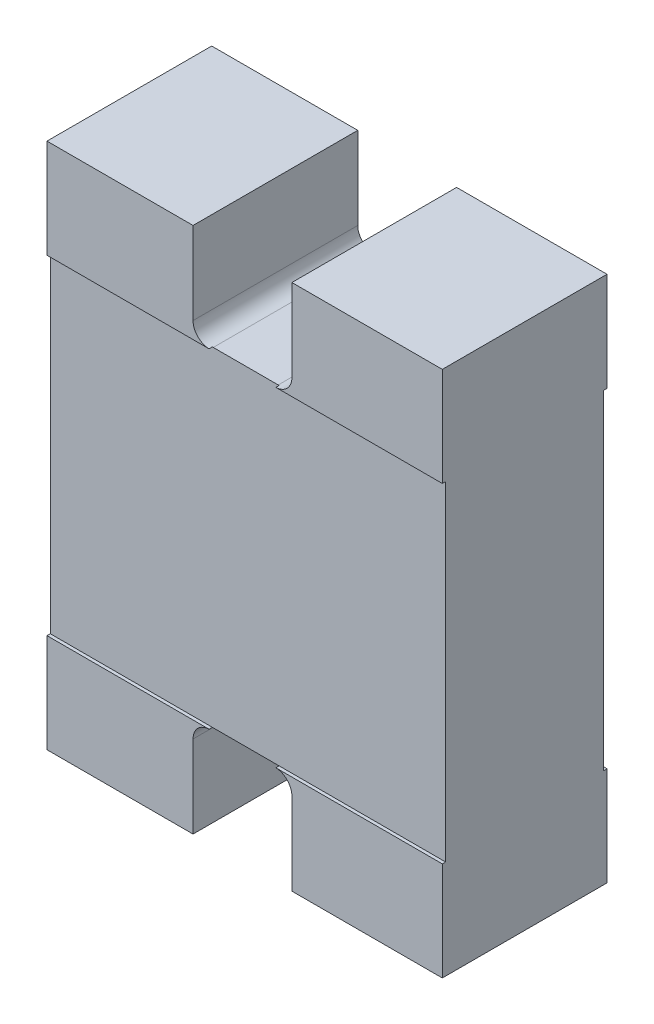
ISO-10303-21;
HEADER;
FILE_DESCRIPTION(('STEP AP214'),'2;1');
FILE_NAME('part.step','',(''),(''),'','','');
FILE_SCHEMA(('AUTOMOTIVE_DESIGN { 1 0 10303 214 1 1 1 1 }'));
ENDSEC;
DATA;
#1=APPLICATION_CONTEXT('core data for automotive mechanical design processes');
#2=APPLICATION_PROTOCOL_DEFINITION('international standard','automotive_design',2000,#1);
#3=PRODUCT_CONTEXT('',#1,'mechanical');
#4=PRODUCT('Part','Part','',(#3));
#5=PRODUCT_RELATED_PRODUCT_CATEGORY('part','',(#4));
#6=PRODUCT_DEFINITION_FORMATION('','',#4);
#7=PRODUCT_DEFINITION_CONTEXT('part definition',#1,'design');
#8=PRODUCT_DEFINITION('design','',#6,#7);
#9=PRODUCT_DEFINITION_SHAPE('','',#8);
#10=(LENGTH_UNIT() NAMED_UNIT(*) SI_UNIT(.MILLI.,.METRE.));
#11=(NAMED_UNIT(*) PLANE_ANGLE_UNIT() SI_UNIT($,.RADIAN.));
#12=(NAMED_UNIT(*) SI_UNIT($,.STERADIAN.) SOLID_ANGLE_UNIT());
#13=UNCERTAINTY_MEASURE_WITH_UNIT(LENGTH_MEASURE(1.E-05),#10,'distance_accuracy_value','');
#14=(GEOMETRIC_REPRESENTATION_CONTEXT(3) GLOBAL_UNCERTAINTY_ASSIGNED_CONTEXT((#13)) GLOBAL_UNIT_ASSIGNED_CONTEXT((#10,
#11,#12)) REPRESENTATION_CONTEXT('',''));
#15=CARTESIAN_POINT('',(0.,0.,0.));
#16=DIRECTION('',(0.,0.,1.));
#17=DIRECTION('',(1.,0.,0.));
#18=AXIS2_PLACEMENT_3D('',#15,#16,#17);
#19=CARTESIAN_POINT('',(0.,0.,0.5));
#20=DIRECTION('',(0.,0.,1.));
#21=DIRECTION('',(1.,0.,0.));
#22=AXIS2_PLACEMENT_3D('',#19,#20,#21);
#23=PLANE('',#22);
#24=DIRECTION('',(0.,1.,0.));
#25=VECTOR('',#24,1.);
#26=CARTESIAN_POINT('',(0.6,0.8,0.5));
#27=LINE('',#26,#25);
#28=CARTESIAN_POINT('',(0.6,-0.8,0.5));
#29=VERTEX_POINT('',#28);
#30=CARTESIAN_POINT('',(0.6,-0.500000000000838,0.5));
#31=VERTEX_POINT('',#30);
#32=EDGE_CURVE('E398',#29,#31,#27,.T.);
#33=ORIENTED_EDGE('',*,*,#32,.T.);
#34=DIRECTION('',(-1.,0.,0.));
#35=VECTOR('',#34,1.);
#36=CARTESIAN_POINT('',(0.6,-0.500000000000838,0.5));
#37=LINE('',#36,#35);
#38=CARTESIAN_POINT('',(0.0947676380211681,-0.500000000000838,0.5));
#39=VERTEX_POINT('',#38);
#40=EDGE_CURVE('E535',#31,#39,#37,.T.);
#41=ORIENTED_EDGE('',*,*,#40,.T.);
#42=CARTESIAN_POINT('',(0.0933814284328622,-0.549979938272866,0.5));
#43=DIRECTION('',(0.,0.,1.));
#44=DIRECTION('',(-1.,0.,0.));
#45=AXIS2_PLACEMENT_3D('',#42,#43,#44);
#46=CIRCLE('',#45,0.0499991580598961);
#47=CARTESIAN_POINT('',(0.143380586492758,-0.549979938272866,0.5));
#48=VERTEX_POINT('',#47);
#49=EDGE_CURVE('E526',#48,#39,#46,.T.);
#50=ORIENTED_EDGE('',*,*,#49,.F.);
#51=DIRECTION('',(-1.05897102086358E-06,0.999999999999439,0.));
#52=VECTOR('',#51,1.);
#53=CARTESIAN_POINT('',(0.143380851256758,-0.8,0.5));
#54=LINE('',#53,#52);
#55=CARTESIAN_POINT('',(0.143380851256758,-0.8,0.5));
#56=VERTEX_POINT('',#55);
#57=EDGE_CURVE('E120',#56,#48,#54,.T.);
#58=ORIENTED_EDGE('',*,*,#57,.F.);
#59=DIRECTION('',(1.,0.,0.));
#60=VECTOR('',#59,1.);
#61=CARTESIAN_POINT('',(-0.6,-0.8,0.5));
#62=LINE('',#61,#60);
#63=EDGE_CURVE('E407',#56,#29,#62,.T.);
#64=ORIENTED_EDGE('',*,*,#63,.T.);
#65=EDGE_LOOP('',(#33,#41,#50,#58,#64));
#66=FACE_BOUND('',#65,.T.);
#67=ADVANCED_FACE('F35',(#66),#23,.T.);
#68=CARTESIAN_POINT('',(-0.106619990683346,-0.549979938272866,0.5));
#69=DIRECTION('',(0.,0.,1.));
#70=DIRECTION('',(1.,0.,0.));
#71=AXIS2_PLACEMENT_3D('',#68,#69,#70);
#72=CIRCLE('',#71,0.0499991580598962);
#73=CARTESIAN_POINT('',(-0.108006200271658,-0.500000000000838,0.5));
#74=VERTEX_POINT('',#73);
#75=CARTESIAN_POINT('',(-0.156619148743242,-0.549979938272866,0.5));
#76=VERTEX_POINT('',#75);
#77=EDGE_CURVE('E524',#74,#76,#72,.T.);
#78=ORIENTED_EDGE('',*,*,#77,.F.);
#79=CARTESIAN_POINT('',(-0.6,-0.500000000000838,0.5));
#80=VERTEX_POINT('',#79);
#81=EDGE_CURVE('E421',#74,#80,#37,.T.);
#82=ORIENTED_EDGE('',*,*,#81,.T.);
#83=DIRECTION('',(0.,-1.,0.));
#84=VECTOR('',#83,1.);
#85=CARTESIAN_POINT('',(-0.6,0.8,0.5));
#86=LINE('',#85,#84);
#87=CARTESIAN_POINT('',(-0.6,-0.8,0.5));
#88=VERTEX_POINT('',#87);
#89=EDGE_CURVE('E404',#80,#88,#86,.T.);
#90=ORIENTED_EDGE('',*,*,#89,.T.);
#91=CARTESIAN_POINT('',(-0.156619148743242,-0.8,0.5));
#92=VERTEX_POINT('',#91);
#93=EDGE_CURVE('E192',#88,#92,#62,.T.);
#94=ORIENTED_EDGE('',*,*,#93,.T.);
#95=DIRECTION('',(0.,-1.,0.));
#96=VECTOR('',#95,1.);
#97=CARTESIAN_POINT('',(-0.156619148743242,-0.8,0.5));
#98=LINE('',#97,#96);
#99=EDGE_CURVE('E137',#76,#92,#98,.T.);
#100=ORIENTED_EDGE('',*,*,#99,.F.);
#101=EDGE_LOOP('',(#78,#82,#90,#94,#100));
#102=FACE_BOUND('',#101,.T.);
#103=ADVANCED_FACE('F417',(#102),#23,.T.);
#104=CARTESIAN_POINT('',(-0.6,0.8,0.5));
#105=VERTEX_POINT('',#104);
#106=CARTESIAN_POINT('',(-0.6,0.500000000000838,0.5));
#107=VERTEX_POINT('',#106);
#108=EDGE_CURVE('E405',#105,#107,#86,.T.);
#109=ORIENTED_EDGE('',*,*,#108,.T.);
#110=DIRECTION('',(1.,0.,0.));
#111=VECTOR('',#110,1.);
#112=CARTESIAN_POINT('',(0.6,0.500000000000838,0.5));
#113=LINE('',#112,#111);
#114=CARTESIAN_POINT('',(-0.108006200271662,0.500000000000838,0.5));
#115=VERTEX_POINT('',#114);
#116=EDGE_CURVE('E350',#107,#115,#113,.T.);
#117=ORIENTED_EDGE('',*,*,#116,.T.);
#118=CARTESIAN_POINT('',(-0.106619990683346,0.549979938272866,0.5));
#119=DIRECTION('',(0.,0.,-1.));
#120=DIRECTION('',(1.,0.,0.));
#121=AXIS2_PLACEMENT_3D('',#118,#119,#120);
#122=CIRCLE('',#121,0.0499991580598962);
#123=CARTESIAN_POINT('',(-0.156619148743242,0.549979938272866,0.5));
#124=VERTEX_POINT('',#123);
#125=EDGE_CURVE('E357',#115,#124,#122,.T.);
#126=ORIENTED_EDGE('',*,*,#125,.T.);
#127=DIRECTION('',(0.,1.,0.));
#128=VECTOR('',#127,1.);
#129=CARTESIAN_POINT('',(-0.156619148743242,0.8,0.5));
#130=LINE('',#129,#128);
#131=CARTESIAN_POINT('',(-0.156619148743242,0.8,0.5));
#132=VERTEX_POINT('',#131);
#133=EDGE_CURVE('E360',#124,#132,#130,.T.);
#134=ORIENTED_EDGE('',*,*,#133,.T.);
#135=DIRECTION('',(-1.,0.,0.));
#136=VECTOR('',#135,1.);
#137=CARTESIAN_POINT('',(-0.6,0.8,0.5));
#138=LINE('',#137,#136);
#139=EDGE_CURVE('E401',#132,#105,#138,.T.);
#140=ORIENTED_EDGE('',*,*,#139,.T.);
#141=EDGE_LOOP('',(#109,#117,#126,#134,#140));
#142=FACE_BOUND('',#141,.T.);
#143=ADVANCED_FACE('F612',(#142),#23,.T.);
#144=CARTESIAN_POINT('',(0.0933814284328622,0.549979938272866,0.5));
#145=DIRECTION('',(0.,0.,-1.));
#146=DIRECTION('',(-1.,0.,0.));
#147=AXIS2_PLACEMENT_3D('',#144,#145,#146);
#148=CIRCLE('',#147,0.0499991580598961);
#149=CARTESIAN_POINT('',(0.143380586492758,0.549979938272866,0.5));
#150=VERTEX_POINT('',#149);
#151=CARTESIAN_POINT('',(0.0947676380211722,0.500000000000838,0.5));
#152=VERTEX_POINT('',#151);
#153=EDGE_CURVE('E361',#150,#152,#148,.T.);
#154=ORIENTED_EDGE('',*,*,#153,.T.);
#155=CARTESIAN_POINT('',(0.6,0.500000000000838,0.5));
#156=VERTEX_POINT('',#155);
#157=EDGE_CURVE('E347',#152,#156,#113,.T.);
#158=ORIENTED_EDGE('',*,*,#157,.T.);
#159=CARTESIAN_POINT('',(0.6,0.8,0.5));
#160=VERTEX_POINT('',#159);
#161=EDGE_CURVE('E183',#156,#160,#27,.T.);
#162=ORIENTED_EDGE('',*,*,#161,.T.);
#163=CARTESIAN_POINT('',(0.143380851256758,0.8,0.5));
#164=VERTEX_POINT('',#163);
#165=EDGE_CURVE('E402',#160,#164,#138,.T.);
#166=ORIENTED_EDGE('',*,*,#165,.T.);
#167=DIRECTION('',(-1.05897102086358E-06,-0.999999999999439,0.));
#168=VECTOR('',#167,1.);
#169=CARTESIAN_POINT('',(0.143380851256758,0.8,0.5));
#170=LINE('',#169,#168);
#171=EDGE_CURVE('E231',#164,#150,#170,.T.);
#172=ORIENTED_EDGE('',*,*,#171,.T.);
#173=EDGE_LOOP('',(#154,#158,#162,#166,#172));
#174=FACE_BOUND('',#173,.T.);
#175=ADVANCED_FACE('F609',(#174),#23,.T.);
#176=CARTESIAN_POINT('',(0.091995218874762,0.5,0.5));
#177=DIRECTION('',(0.,-1.,0.));
#178=DIRECTION('',(0.,0.,-1.));
#179=AXIS2_PLACEMENT_3D('',#176,#177,#178);
#180=PLANE('',#179);
#181=DIRECTION('',(1.,0.,0.));
#182=VECTOR('',#181,1.);
#183=CARTESIAN_POINT('',(0.6,0.500000000000838,0.49));
#184=LINE('',#183,#182);
#185=CARTESIAN_POINT('',(-0.105233781110134,0.500000000000419,0.49));
#186=VERTEX_POINT('',#185);
#187=CARTESIAN_POINT('',(0.0919952188596571,0.500000000000419,0.49));
#188=VERTEX_POINT('',#187);
#189=EDGE_CURVE('E383',#186,#188,#184,.T.);
#190=ORIENTED_EDGE('',*,*,#189,.T.);
#191=DIRECTION('',(0.,0.,-1.));
#192=VECTOR('',#191,1.);
#193=CARTESIAN_POINT('',(0.091995218874762,0.5,0.5));
#194=LINE('',#193,#192);
#195=CARTESIAN_POINT('',(0.0919952188596571,0.500000000000419,0.01));
#196=VERTEX_POINT('',#195);
#197=EDGE_CURVE('E385',#188,#196,#194,.T.);
#198=ORIENTED_EDGE('',*,*,#197,.T.);
#199=DIRECTION('',(1.,0.,0.));
#200=VECTOR('',#199,1.);
#201=CARTESIAN_POINT('',(0.6,0.500000000000838,0.01));
#202=LINE('',#201,#200);
#203=CARTESIAN_POINT('',(-0.105233781110134,0.500000000000419,0.01));
#204=VERTEX_POINT('',#203);
#205=EDGE_CURVE('E255',#204,#196,#202,.T.);
#206=ORIENTED_EDGE('',*,*,#205,.F.);
#207=DIRECTION('',(0.,0.,-1.));
#208=VECTOR('',#207,1.);
#209=CARTESIAN_POINT('',(-0.105233781125238,0.5,0.5));
#210=LINE('',#209,#208);
#211=EDGE_CURVE('E376',#186,#204,#210,.T.);
#212=ORIENTED_EDGE('',*,*,#211,.F.);
#213=EDGE_LOOP('',(#190,#198,#206,#212));
#214=FACE_BOUND('',#213,.T.);
#215=ADVANCED_FACE('F381',(#214),#180,.F.);
#216=CARTESIAN_POINT('',(0.6,0.8,0.5));
#217=DIRECTION('',(-1.,0.,0.));
#218=DIRECTION('',(0.,-1.,0.));
#219=AXIS2_PLACEMENT_3D('',#216,#217,#218);
#220=PLANE('',#219);
#221=DIRECTION('',(0.,0.,1.));
#222=VECTOR('',#221,1.);
#223=CARTESIAN_POINT('',(0.6,-0.500000000000838,0.49));
#224=LINE('',#223,#222);
#225=CARTESIAN_POINT('',(0.6,-0.500000000000838,0.49));
#226=VERTEX_POINT('',#225);
#227=EDGE_CURVE('E366',#226,#31,#224,.T.);
#228=ORIENTED_EDGE('',*,*,#227,.T.);
#229=ORIENTED_EDGE('',*,*,#32,.F.);
#230=DIRECTION('',(0.,0.,-1.));
#231=VECTOR('',#230,1.);
#232=CARTESIAN_POINT('',(0.6,-0.8,0.5));
#233=LINE('',#232,#231);
#234=CARTESIAN_POINT('',(0.6,-0.8,0.));
#235=VERTEX_POINT('',#234);
#236=EDGE_CURVE('E189',#29,#235,#233,.T.);
#237=ORIENTED_EDGE('',*,*,#236,.T.);
#238=DIRECTION('',(0.,1.,0.));
#239=VECTOR('',#238,1.);
#240=CARTESIAN_POINT('',(0.6,0.8,0.));
#241=LINE('',#240,#239);
#242=CARTESIAN_POINT('',(0.6,-0.500000000000838,0.));
#243=VERTEX_POINT('',#242);
#244=EDGE_CURVE('E173',#235,#243,#241,.T.);
#245=ORIENTED_EDGE('',*,*,#244,.T.);
#246=DIRECTION('',(0.,0.,-1.));
#247=VECTOR('',#246,1.);
#248=CARTESIAN_POINT('',(0.6,-0.500000000000838,0.01));
#249=LINE('',#248,#247);
#250=CARTESIAN_POINT('',(0.6,-0.500000000000838,0.01));
#251=VERTEX_POINT('',#250);
#252=EDGE_CURVE('E247',#251,#243,#249,.T.);
#253=ORIENTED_EDGE('',*,*,#252,.F.);
#254=DIRECTION('',(0.,-1.,0.));
#255=VECTOR('',#254,1.);
#256=CARTESIAN_POINT('',(0.6,0.500000000000838,0.01));
#257=LINE('',#256,#255);
#258=CARTESIAN_POINT('',(0.6,0.500000000000838,0.01));
#259=VERTEX_POINT('',#258);
#260=EDGE_CURVE('E230',#259,#251,#257,.T.);
#261=ORIENTED_EDGE('',*,*,#260,.F.);
#262=DIRECTION('',(0.,0.,-1.));
#263=VECTOR('',#262,1.);
#264=CARTESIAN_POINT('',(0.6,0.500000000000838,0.01));
#265=LINE('',#264,#263);
#266=CARTESIAN_POINT('',(0.6,0.500000000000838,0.));
#267=VERTEX_POINT('',#266);
#268=EDGE_CURVE('E238',#259,#267,#265,.T.);
#269=ORIENTED_EDGE('',*,*,#268,.T.);
#270=CARTESIAN_POINT('',(0.6,0.8,0.));
#271=VERTEX_POINT('',#270);
#272=EDGE_CURVE('E294',#267,#271,#241,.T.);
#273=ORIENTED_EDGE('',*,*,#272,.T.);
#274=DIRECTION('',(0.,0.,-1.));
#275=VECTOR('',#274,1.);
#276=CARTESIAN_POINT('',(0.6,0.8,0.5));
#277=LINE('',#276,#275);
#278=EDGE_CURVE('E198',#160,#271,#277,.T.);
#279=ORIENTED_EDGE('',*,*,#278,.F.);
#280=ORIENTED_EDGE('',*,*,#161,.F.);
#281=DIRECTION('',(0.,0.,1.));
#282=VECTOR('',#281,1.);
#283=CARTESIAN_POINT('',(0.6,0.500000000000838,0.49));
#284=LINE('',#283,#282);
#285=CARTESIAN_POINT('',(0.6,0.500000000000838,0.49));
#286=VERTEX_POINT('',#285);
#287=EDGE_CURVE('E546',#286,#156,#284,.T.);
#288=ORIENTED_EDGE('',*,*,#287,.F.);
#289=DIRECTION('',(0.,-1.,0.));
#290=VECTOR('',#289,1.);
#291=CARTESIAN_POINT('',(0.6,0.500000000000838,0.49));
#292=LINE('',#291,#290);
#293=EDGE_CURVE('E537',#286,#226,#292,.T.);
#294=ORIENTED_EDGE('',*,*,#293,.T.);
#295=EDGE_LOOP('',(#228,#229,#237,#245,#253,#261,#269,#273,#279,#280,#288,#294));
#296=FACE_BOUND('',#295,.T.);
#297=ADVANCED_FACE('F37',(#296),#220,.F.);
#298=CARTESIAN_POINT('',(-0.6,0.8,0.5));
#299=DIRECTION('',(1.,0.,0.));
#300=DIRECTION('',(0.,1.,0.));
#301=AXIS2_PLACEMENT_3D('',#298,#299,#300);
#302=PLANE('',#301);
#303=DIRECTION('',(0.,0.,1.));
#304=VECTOR('',#303,1.);
#305=CARTESIAN_POINT('',(-0.6,-0.500000000000838,0.49));
#306=LINE('',#305,#304);
#307=CARTESIAN_POINT('',(-0.6,-0.500000000000838,0.49));
#308=VERTEX_POINT('',#307);
#309=EDGE_CURVE('E428',#308,#80,#306,.T.);
#310=ORIENTED_EDGE('',*,*,#309,.F.);
#311=DIRECTION('',(0.,1.,0.));
#312=VECTOR('',#311,1.);
#313=CARTESIAN_POINT('',(-0.6,0.500000000000838,0.49));
#314=LINE('',#313,#312);
#315=CARTESIAN_POINT('',(-0.6,0.500000000000838,0.49));
#316=VERTEX_POINT('',#315);
#317=EDGE_CURVE('E557',#308,#316,#314,.T.);
#318=ORIENTED_EDGE('',*,*,#317,.T.);
#319=DIRECTION('',(0.,0.,1.));
#320=VECTOR('',#319,1.);
#321=CARTESIAN_POINT('',(-0.6,0.500000000000838,0.49));
#322=LINE('',#321,#320);
#323=EDGE_CURVE('E544',#316,#107,#322,.T.);
#324=ORIENTED_EDGE('',*,*,#323,.T.);
#325=ORIENTED_EDGE('',*,*,#108,.F.);
#326=DIRECTION('',(0.,0.,-1.));
#327=VECTOR('',#326,1.);
#328=CARTESIAN_POINT('',(-0.6,0.8,0.5));
#329=LINE('',#328,#327);
#330=CARTESIAN_POINT('',(-0.6,0.8,0.));
#331=VERTEX_POINT('',#330);
#332=EDGE_CURVE('E195',#105,#331,#329,.T.);
#333=ORIENTED_EDGE('',*,*,#332,.T.);
#334=DIRECTION('',(0.,-1.,0.));
#335=VECTOR('',#334,1.);
#336=CARTESIAN_POINT('',(-0.6,0.8,0.));
#337=LINE('',#336,#335);
#338=CARTESIAN_POINT('',(-0.6,0.500000000000838,0.));
#339=VERTEX_POINT('',#338);
#340=EDGE_CURVE('E180',#331,#339,#337,.T.);
#341=ORIENTED_EDGE('',*,*,#340,.T.);
#342=DIRECTION('',(0.,0.,-1.));
#343=VECTOR('',#342,1.);
#344=CARTESIAN_POINT('',(-0.6,0.500000000000838,0.01));
#345=LINE('',#344,#343);
#346=CARTESIAN_POINT('',(-0.6,0.500000000000838,0.01));
#347=VERTEX_POINT('',#346);
#348=EDGE_CURVE('E242',#347,#339,#345,.T.);
#349=ORIENTED_EDGE('',*,*,#348,.F.);
#350=DIRECTION('',(0.,1.,0.));
#351=VECTOR('',#350,1.);
#352=CARTESIAN_POINT('',(-0.6,0.500000000000838,0.01));
#353=LINE('',#352,#351);
#354=CARTESIAN_POINT('',(-0.6,-0.500000000000838,0.01));
#355=VERTEX_POINT('',#354);
#356=EDGE_CURVE('E266',#355,#347,#353,.T.);
#357=ORIENTED_EDGE('',*,*,#356,.F.);
#358=DIRECTION('',(0.,0.,-1.));
#359=VECTOR('',#358,1.);
#360=CARTESIAN_POINT('',(-0.6,-0.500000000000838,0.01));
#361=LINE('',#360,#359);
#362=CARTESIAN_POINT('',(-0.6,-0.500000000000838,0.));
#363=VERTEX_POINT('',#362);
#364=EDGE_CURVE('E245',#355,#363,#361,.T.);
#365=ORIENTED_EDGE('',*,*,#364,.T.);
#366=CARTESIAN_POINT('',(-0.6,-0.8,0.));
#367=VERTEX_POINT('',#366);
#368=EDGE_CURVE('E185',#363,#367,#337,.T.);
#369=ORIENTED_EDGE('',*,*,#368,.T.);
#370=DIRECTION('',(0.,0.,-1.));
#371=VECTOR('',#370,1.);
#372=CARTESIAN_POINT('',(-0.6,-0.8,0.5));
#373=LINE('',#372,#371);
#374=EDGE_CURVE('E191',#88,#367,#373,.T.);
#375=ORIENTED_EDGE('',*,*,#374,.F.);
#376=ORIENTED_EDGE('',*,*,#89,.F.);
#377=EDGE_LOOP('',(#310,#318,#324,#325,#333,#341,#349,#357,#365,#369,#375,#376));
#378=FACE_BOUND('',#377,.T.);
#379=ADVANCED_FACE('F313',(#378),#302,.F.);
#380=CARTESIAN_POINT('',(-0.106619990683346,0.549979938272866,0.5));
#381=DIRECTION('',(0.,0.,-1.));
#382=DIRECTION('',(-1.,0.,0.));
#383=AXIS2_PLACEMENT_3D('',#380,#381,#382);
#384=CYLINDRICAL_SURFACE('',#383,0.0499991580598962);
#385=DIRECTION('',(0.,0.,-1.));
#386=VECTOR('',#385,1.);
#387=CARTESIAN_POINT('',(-0.108006200271662,0.500000000000838,0.5));
#388=LINE('',#387,#386);
#389=CARTESIAN_POINT('',(-0.108006200271662,0.500000000000838,0.49));
#390=VERTEX_POINT('',#389);
#391=EDGE_CURVE('E333',#390,#115,#388,.F.);
#392=ORIENTED_EDGE('',*,*,#391,.F.);
#393=CARTESIAN_POINT('',(-0.106619990683346,0.549979938272866,0.49));
#394=DIRECTION('',(0.,0.,-1.));
#395=DIRECTION('',(-1.,0.,0.));
#396=AXIS2_PLACEMENT_3D('',#393,#394,#395);
#397=CIRCLE('',#396,0.0499991580598962);
#398=EDGE_CURVE('E39',#390,#186,#397,.F.);
#399=ORIENTED_EDGE('',*,*,#398,.T.);
#400=ORIENTED_EDGE('',*,*,#211,.T.);
#401=CARTESIAN_POINT('',(-0.106619990683346,0.549979938272866,0.01));
#402=DIRECTION('',(0.,0.,-1.));
#403=DIRECTION('',(-1.,0.,0.));
#404=AXIS2_PLACEMENT_3D('',#401,#402,#403);
#405=CIRCLE('',#404,0.0499991580598962);
#406=CARTESIAN_POINT('',(-0.108006200271662,0.500000000000838,0.01));
#407=VERTEX_POINT('',#406);
#408=EDGE_CURVE('E223',#407,#204,#405,.F.);
#409=ORIENTED_EDGE('',*,*,#408,.F.);
#410=DIRECTION('',(0.,0.,-1.));
#411=VECTOR('',#410,1.);
#412=CARTESIAN_POINT('',(-0.108006200271662,0.500000000000838,0.5));
#413=LINE('',#412,#411);
#414=CARTESIAN_POINT('',(-0.108006200271662,0.500000000000838,0.));
#415=VERTEX_POINT('',#414);
#416=EDGE_CURVE('E219',#407,#415,#413,.T.);
#417=ORIENTED_EDGE('',*,*,#416,.T.);
#418=CARTESIAN_POINT('',(-0.106619990683346,0.549979938272866,0.));
#419=DIRECTION('',(0.,0.,-1.));
#420=DIRECTION('',(1.,0.,0.));
#421=AXIS2_PLACEMENT_3D('',#418,#419,#420);
#422=CIRCLE('',#421,0.0499991580598962);
#423=CARTESIAN_POINT('',(-0.156619148743242,0.549979938272866,0.));
#424=VERTEX_POINT('',#423);
#425=EDGE_CURVE('E211',#415,#424,#422,.T.);
#426=ORIENTED_EDGE('',*,*,#425,.T.);
#427=DIRECTION('',(0.,0.,-1.));
#428=VECTOR('',#427,1.);
#429=CARTESIAN_POINT('',(-0.156619148743242,0.549979938272866,0.5));
#430=LINE('',#429,#428);
#431=EDGE_CURVE('E384',#124,#424,#430,.T.);
#432=ORIENTED_EDGE('',*,*,#431,.F.);
#433=ORIENTED_EDGE('',*,*,#125,.F.);
#434=EDGE_LOOP('',(#392,#399,#400,#409,#417,#426,#432,#433));
#435=FACE_BOUND('',#434,.T.);
#436=ADVANCED_FACE('F374',(#435),#384,.F.);
#437=CARTESIAN_POINT('',(0.0933814284328622,0.549979938272866,0.5));
#438=DIRECTION('',(0.,0.,-1.));
#439=DIRECTION('',(-1.,0.,0.));
#440=AXIS2_PLACEMENT_3D('',#437,#438,#439);
#441=CYLINDRICAL_SURFACE('',#440,0.0499991580598961);
#442=DIRECTION('',(0.,0.,-1.));
#443=VECTOR('',#442,1.);
#444=CARTESIAN_POINT('',(0.0947676380211722,0.500000000000838,0.5));
#445=LINE('',#444,#443);
#446=CARTESIAN_POINT('',(0.0947676380211722,0.500000000000838,0.49));
#447=VERTEX_POINT('',#446);
#448=EDGE_CURVE('E11',#152,#447,#445,.T.);
#449=ORIENTED_EDGE('',*,*,#448,.F.);
#450=ORIENTED_EDGE('',*,*,#153,.F.);
#451=DIRECTION('',(0.,0.,-1.));
#452=VECTOR('',#451,1.);
#453=CARTESIAN_POINT('',(0.143380586492758,0.549979938272866,0.5));
#454=LINE('',#453,#452);
#455=CARTESIAN_POINT('',(0.143380586492758,0.549979938272866,0.));
#456=VERTEX_POINT('',#455);
#457=EDGE_CURVE('E389',#150,#456,#454,.T.);
#458=ORIENTED_EDGE('',*,*,#457,.T.);
#459=CARTESIAN_POINT('',(0.0933814284328622,0.549979938272866,0.));
#460=DIRECTION('',(0.,0.,-1.));
#461=DIRECTION('',(-1.,0.,0.));
#462=AXIS2_PLACEMENT_3D('',#459,#460,#461);
#463=CIRCLE('',#462,0.0499991580598961);
#464=CARTESIAN_POINT('',(0.0947676380211722,0.500000000000838,0.));
#465=VERTEX_POINT('',#464);
#466=EDGE_CURVE('E208',#456,#465,#463,.T.);
#467=ORIENTED_EDGE('',*,*,#466,.T.);
#468=DIRECTION('',(0.,0.,-1.));
#469=VECTOR('',#468,1.);
#470=CARTESIAN_POINT('',(0.0947676380211722,0.500000000000838,0.5));
#471=LINE('',#470,#469);
#472=CARTESIAN_POINT('',(0.0947676380211722,0.500000000000838,0.01));
#473=VERTEX_POINT('',#472);
#474=EDGE_CURVE('E204',#465,#473,#471,.F.);
#475=ORIENTED_EDGE('',*,*,#474,.T.);
#476=CARTESIAN_POINT('',(0.0933814284328622,0.549979938272866,0.01));
#477=DIRECTION('',(0.,0.,-1.));
#478=DIRECTION('',(-1.,0.,0.));
#479=AXIS2_PLACEMENT_3D('',#476,#477,#478);
#480=CIRCLE('',#479,0.0499991580598961);
#481=EDGE_CURVE('E201',#196,#473,#480,.F.);
#482=ORIENTED_EDGE('',*,*,#481,.F.);
#483=ORIENTED_EDGE('',*,*,#197,.F.);
#484=CARTESIAN_POINT('',(0.0933814284328622,0.549979938272866,0.49));
#485=DIRECTION('',(0.,0.,-1.));
#486=DIRECTION('',(-1.,0.,0.));
#487=AXIS2_PLACEMENT_3D('',#484,#485,#486);
#488=CIRCLE('',#487,0.0499991580598961);
#489=EDGE_CURVE('E365',#188,#447,#488,.F.);
#490=ORIENTED_EDGE('',*,*,#489,.T.);
#491=EDGE_LOOP('',(#449,#450,#458,#467,#475,#482,#483,#490));
#492=FACE_BOUND('',#491,.T.);
#493=ADVANCED_FACE('F811',(#492),#441,.F.);
#494=CARTESIAN_POINT('',(0.0933814284328622,-0.549979938272866,0.5));
#495=DIRECTION('',(0.,0.,-1.));
#496=DIRECTION('',(-1.,0.,0.));
#497=AXIS2_PLACEMENT_3D('',#494,#495,#496);
#498=CYLINDRICAL_SURFACE('',#497,0.0499991580598961);
#499=ORIENTED_EDGE('',*,*,#49,.T.);
#500=DIRECTION('',(0.,0.,-1.));
#501=VECTOR('',#500,1.);
#502=CARTESIAN_POINT('',(0.0947676380211681,-0.500000000000838,0.5));
#503=LINE('',#502,#501);
#504=CARTESIAN_POINT('',(0.0947676380211682,-0.500000000000838,0.49));
#505=VERTEX_POINT('',#504);
#506=EDGE_CURVE('E335',#39,#505,#503,.T.);
#507=ORIENTED_EDGE('',*,*,#506,.T.);
#508=CARTESIAN_POINT('',(0.0933814284328622,-0.549979938272866,0.49));
#509=DIRECTION('',(0.,0.,-1.));
#510=DIRECTION('',(-1.,0.,0.));
#511=AXIS2_PLACEMENT_3D('',#508,#509,#510);
#512=CIRCLE('',#511,0.0499991580598961);
#513=CARTESIAN_POINT('',(0.0919952188596591,-0.500000000000419,0.49));
#514=VERTEX_POINT('',#513);
#515=EDGE_CURVE('E364',#505,#514,#512,.F.);
#516=ORIENTED_EDGE('',*,*,#515,.T.);
#517=DIRECTION('',(0.,0.,-1.));
#518=VECTOR('',#517,1.);
#519=CARTESIAN_POINT('',(0.091995218874762,-0.5,0.5));
#520=LINE('',#519,#518);
#521=CARTESIAN_POINT('',(0.0919952188596591,-0.500000000000419,0.01));
#522=VERTEX_POINT('',#521);
#523=EDGE_CURVE('E101',#514,#522,#520,.T.);
#524=ORIENTED_EDGE('',*,*,#523,.T.);
#525=CARTESIAN_POINT('',(0.0933814284328622,-0.549979938272866,0.01));
#526=DIRECTION('',(0.,0.,-1.));
#527=DIRECTION('',(-1.,0.,0.));
#528=AXIS2_PLACEMENT_3D('',#525,#526,#527);
#529=CIRCLE('',#528,0.0499991580598961);
#530=CARTESIAN_POINT('',(0.0947676380211682,-0.500000000000838,0.01));
#531=VERTEX_POINT('',#530);
#532=EDGE_CURVE('E511',#531,#522,#529,.F.);
#533=ORIENTED_EDGE('',*,*,#532,.F.);
#534=DIRECTION('',(0.,0.,-1.));
#535=VECTOR('',#534,1.);
#536=CARTESIAN_POINT('',(0.0947676380211681,-0.500000000000838,0.5));
#537=LINE('',#536,#535);
#538=CARTESIAN_POINT('',(0.0947676380211681,-0.500000000000838,0.));
#539=VERTEX_POINT('',#538);
#540=EDGE_CURVE('E90',#531,#539,#537,.T.);
#541=ORIENTED_EDGE('',*,*,#540,.T.);
#542=CARTESIAN_POINT('',(0.0933814284328622,-0.549979938272866,0.));
#543=DIRECTION('',(0.,0.,1.));
#544=DIRECTION('',(-1.,0.,0.));
#545=AXIS2_PLACEMENT_3D('',#542,#543,#544);
#546=CIRCLE('',#545,0.0499991580598961);
#547=CARTESIAN_POINT('',(0.143380586492758,-0.549979938272866,0.));
#548=VERTEX_POINT('',#547);
#549=EDGE_CURVE('E125',#548,#539,#546,.T.);
#550=ORIENTED_EDGE('',*,*,#549,.F.);
#551=DIRECTION('',(0.,0.,-1.));
#552=VECTOR('',#551,1.);
#553=CARTESIAN_POINT('',(0.143380586492758,-0.549979938272866,0.5));
#554=LINE('',#553,#552);
#555=EDGE_CURVE('E111',#48,#548,#554,.T.);
#556=ORIENTED_EDGE('',*,*,#555,.F.);
#557=EDGE_LOOP('',(#499,#507,#516,#524,#533,#541,#550,#556));
#558=FACE_BOUND('',#557,.T.);
#559=ADVANCED_FACE('F159',(#558),#498,.F.);
#560=CARTESIAN_POINT('',(0.091995218874762,-0.5,0.5));
#561=DIRECTION('',(0.,-1.,0.));
#562=DIRECTION('',(0.,0.,-1.));
#563=AXIS2_PLACEMENT_3D('',#560,#561,#562);
#564=PLANE('',#563);
#565=ORIENTED_EDGE('',*,*,#523,.F.);
#566=DIRECTION('',(-1.,0.,0.));
#567=VECTOR('',#566,1.);
#568=CARTESIAN_POINT('',(0.6,-0.500000000000838,0.49));
#569=LINE('',#568,#567);
#570=CARTESIAN_POINT('',(-0.105233781110136,-0.500000000000419,0.49));
#571=VERTEX_POINT('',#570);
#572=EDGE_CURVE('E85',#514,#571,#569,.T.);
#573=ORIENTED_EDGE('',*,*,#572,.T.);
#574=DIRECTION('',(0.,0.,-1.));
#575=VECTOR('',#574,1.);
#576=CARTESIAN_POINT('',(-0.105233781125238,-0.5,0.5));
#577=LINE('',#576,#575);
#578=CARTESIAN_POINT('',(-0.105233781110136,-0.500000000000419,0.01));
#579=VERTEX_POINT('',#578);
#580=EDGE_CURVE('E98',#571,#579,#577,.T.);
#581=ORIENTED_EDGE('',*,*,#580,.T.);
#582=DIRECTION('',(-1.,0.,0.));
#583=VECTOR('',#582,1.);
#584=CARTESIAN_POINT('',(0.6,-0.500000000000838,0.01));
#585=LINE('',#584,#583);
#586=EDGE_CURVE('E277',#522,#579,#585,.T.);
#587=ORIENTED_EDGE('',*,*,#586,.F.);
#588=EDGE_LOOP('',(#565,#573,#581,#587));
#589=FACE_BOUND('',#588,.T.);
#590=ADVANCED_FACE('F95',(#589),#564,.T.);
#591=CARTESIAN_POINT('',(-0.106619990683346,-0.549979938272866,0.5));
#592=DIRECTION('',(0.,0.,-1.));
#593=DIRECTION('',(-1.,0.,0.));
#594=AXIS2_PLACEMENT_3D('',#591,#592,#593);
#595=CYLINDRICAL_SURFACE('',#594,0.0499991580598962);
#596=CARTESIAN_POINT('',(-0.106619990683346,-0.549979938272866,0.49));
#597=DIRECTION('',(0.,0.,-1.));
#598=DIRECTION('',(-1.,0.,0.));
#599=AXIS2_PLACEMENT_3D('',#596,#597,#598);
#600=CIRCLE('',#599,0.0499991580598962);
#601=CARTESIAN_POINT('',(-0.108006200271658,-0.500000000000838,0.49));
#602=VERTEX_POINT('',#601);
#603=EDGE_CURVE('E82',#571,#602,#600,.F.);
#604=ORIENTED_EDGE('',*,*,#603,.T.);
#605=DIRECTION('',(0.,0.,-1.));
#606=VECTOR('',#605,1.);
#607=CARTESIAN_POINT('',(-0.108006200271658,-0.500000000000838,0.5));
#608=LINE('',#607,#606);
#609=EDGE_CURVE('E45',#602,#74,#608,.F.);
#610=ORIENTED_EDGE('',*,*,#609,.T.);
#611=ORIENTED_EDGE('',*,*,#77,.T.);
#612=DIRECTION('',(0.,0.,-1.));
#613=VECTOR('',#612,1.);
#614=CARTESIAN_POINT('',(-0.156619148743242,-0.549979938272866,0.5));
#615=LINE('',#614,#613);
#616=CARTESIAN_POINT('',(-0.156619148743242,-0.549979938272866,0.));
#617=VERTEX_POINT('',#616);
#618=EDGE_CURVE('E109',#76,#617,#615,.T.);
#619=ORIENTED_EDGE('',*,*,#618,.T.);
#620=CARTESIAN_POINT('',(-0.106619990683346,-0.549979938272866,0.));
#621=DIRECTION('',(0.,0.,1.));
#622=DIRECTION('',(1.,0.,0.));
#623=AXIS2_PLACEMENT_3D('',#620,#621,#622);
#624=CIRCLE('',#623,0.0499991580598962);
#625=CARTESIAN_POINT('',(-0.108006200271658,-0.500000000000838,0.));
#626=VERTEX_POINT('',#625);
#627=EDGE_CURVE('E121',#626,#617,#624,.T.);
#628=ORIENTED_EDGE('',*,*,#627,.F.);
#629=DIRECTION('',(0.,0.,-1.));
#630=VECTOR('',#629,1.);
#631=CARTESIAN_POINT('',(-0.108006200271658,-0.500000000000838,0.5));
#632=LINE('',#631,#630);
#633=CARTESIAN_POINT('',(-0.108006200271658,-0.500000000000838,0.01));
#634=VERTEX_POINT('',#633);
#635=EDGE_CURVE('E207',#626,#634,#632,.F.);
#636=ORIENTED_EDGE('',*,*,#635,.T.);
#637=CARTESIAN_POINT('',(-0.106619990683346,-0.549979938272866,0.01));
#638=DIRECTION('',(0.,0.,-1.));
#639=DIRECTION('',(-1.,0.,0.));
#640=AXIS2_PLACEMENT_3D('',#637,#638,#639);
#641=CIRCLE('',#640,0.0499991580598962);
#642=EDGE_CURVE('E107',#579,#634,#641,.F.);
#643=ORIENTED_EDGE('',*,*,#642,.F.);
#644=ORIENTED_EDGE('',*,*,#580,.F.);
#645=EDGE_LOOP('',(#604,#610,#611,#619,#628,#636,#643,#644));
#646=FACE_BOUND('',#645,.T.);
#647=ADVANCED_FACE('F104',(#646),#595,.F.);
#648=CARTESIAN_POINT('',(-0.6,-0.8,0.5));
#649=DIRECTION('',(0.,1.,0.));
#650=DIRECTION('',(0.,0.,1.));
#651=AXIS2_PLACEMENT_3D('',#648,#649,#650);
#652=PLANE('',#651);
#653=DIRECTION('',(0.,0.,-1.));
#654=VECTOR('',#653,1.);
#655=CARTESIAN_POINT('',(0.143380851256758,-0.8,0.5));
#656=LINE('',#655,#654);
#657=CARTESIAN_POINT('',(0.143380851256758,-0.8,0.));
#658=VERTEX_POINT('',#657);
#659=EDGE_CURVE('E138',#56,#658,#656,.T.);
#660=ORIENTED_EDGE('',*,*,#659,.T.);
#661=DIRECTION('',(1.,0.,0.));
#662=VECTOR('',#661,1.);
#663=CARTESIAN_POINT('',(-0.6,-0.8,0.));
#664=LINE('',#663,#662);
#665=EDGE_CURVE('E170',#658,#235,#664,.T.);
#666=ORIENTED_EDGE('',*,*,#665,.T.);
#667=ORIENTED_EDGE('',*,*,#236,.F.);
#668=ORIENTED_EDGE('',*,*,#63,.F.);
#669=EDGE_LOOP('',(#660,#666,#667,#668));
#670=FACE_BOUND('',#669,.T.);
#671=ADVANCED_FACE('F732',(#670),#652,.F.);
#672=DIRECTION('',(0.,0.,-1.));
#673=VECTOR('',#672,1.);
#674=CARTESIAN_POINT('',(-0.156619148743242,-0.8,0.5));
#675=LINE('',#674,#673);
#676=CARTESIAN_POINT('',(-0.156619148743242,-0.8,0.));
#677=VERTEX_POINT('',#676);
#678=EDGE_CURVE('E114',#92,#677,#675,.T.);
#679=ORIENTED_EDGE('',*,*,#678,.F.);
#680=ORIENTED_EDGE('',*,*,#93,.F.);
#681=ORIENTED_EDGE('',*,*,#374,.T.);
#682=EDGE_CURVE('E179',#367,#677,#664,.T.);
#683=ORIENTED_EDGE('',*,*,#682,.T.);
#684=EDGE_LOOP('',(#679,#680,#681,#683));
#685=FACE_BOUND('',#684,.T.);
#686=ADVANCED_FACE('F325',(#685),#652,.F.);
#687=CARTESIAN_POINT('',(0.,0.,0.));
#688=DIRECTION('',(0.,0.,1.));
#689=DIRECTION('',(1.,0.,0.));
#690=AXIS2_PLACEMENT_3D('',#687,#688,#689);
#691=PLANE('',#690);
#692=DIRECTION('',(-1.05897102086358E-06,0.999999999999439,0.));
#693=VECTOR('',#692,1.);
#694=CARTESIAN_POINT('',(0.143380851256758,-0.8,0.));
#695=LINE('',#694,#693);
#696=EDGE_CURVE('E134',#658,#548,#695,.T.);
#697=ORIENTED_EDGE('',*,*,#696,.T.);
#698=ORIENTED_EDGE('',*,*,#549,.T.);
#699=DIRECTION('',(-1.,0.,0.));
#700=VECTOR('',#699,1.);
#701=CARTESIAN_POINT('',(0.6,-0.500000000000838,0.));
#702=LINE('',#701,#700);
#703=EDGE_CURVE('E514',#243,#539,#702,.T.);
#704=ORIENTED_EDGE('',*,*,#703,.F.);
#705=ORIENTED_EDGE('',*,*,#244,.F.);
#706=ORIENTED_EDGE('',*,*,#665,.F.);
#707=EDGE_LOOP('',(#697,#698,#704,#705,#706));
#708=FACE_BOUND('',#707,.T.);
#709=ADVANCED_FACE('F167',(#708),#691,.F.);
#710=ORIENTED_EDGE('',*,*,#627,.T.);
#711=DIRECTION('',(0.,-1.,0.));
#712=VECTOR('',#711,1.);
#713=CARTESIAN_POINT('',(-0.156619148743242,-0.8,0.));
#714=LINE('',#713,#712);
#715=EDGE_CURVE('E126',#617,#677,#714,.T.);
#716=ORIENTED_EDGE('',*,*,#715,.T.);
#717=ORIENTED_EDGE('',*,*,#682,.F.);
#718=ORIENTED_EDGE('',*,*,#368,.F.);
#719=EDGE_CURVE('E512',#626,#363,#702,.T.);
#720=ORIENTED_EDGE('',*,*,#719,.F.);
#721=EDGE_LOOP('',(#710,#716,#717,#718,#720));
#722=FACE_BOUND('',#721,.T.);
#723=ADVANCED_FACE('F328',(#722),#691,.F.);
#724=CARTESIAN_POINT('',(0.,0.,0.01));
#725=DIRECTION('',(0.,0.,-1.));
#726=DIRECTION('',(-1.,0.,0.));
#727=AXIS2_PLACEMENT_3D('',#724,#725,#726);
#728=PLANE('',#727);
#729=EDGE_CURVE('E272',#251,#531,#585,.T.);
#730=ORIENTED_EDGE('',*,*,#729,.T.);
#731=ORIENTED_EDGE('',*,*,#532,.T.);
#732=ORIENTED_EDGE('',*,*,#586,.T.);
#733=ORIENTED_EDGE('',*,*,#642,.T.);
#734=EDGE_CURVE('E279',#634,#355,#585,.T.);
#735=ORIENTED_EDGE('',*,*,#734,.T.);
#736=ORIENTED_EDGE('',*,*,#356,.T.);
#737=EDGE_CURVE('E249',#347,#407,#202,.T.);
#738=ORIENTED_EDGE('',*,*,#737,.T.);
#739=ORIENTED_EDGE('',*,*,#408,.T.);
#740=ORIENTED_EDGE('',*,*,#205,.T.);
#741=ORIENTED_EDGE('',*,*,#481,.T.);
#742=EDGE_CURVE('E256',#473,#259,#202,.T.);
#743=ORIENTED_EDGE('',*,*,#742,.T.);
#744=ORIENTED_EDGE('',*,*,#260,.T.);
#745=EDGE_LOOP('',(#730,#731,#732,#733,#735,#736,#738,#739,#740,#741,#743,#744));
#746=FACE_BOUND('',#745,.T.);
#747=ADVANCED_FACE('F282',(#746),#728,.T.);
#748=CARTESIAN_POINT('',(0.6,-0.500000000000838,0.01));
#749=DIRECTION('',(0.,-1.,0.));
#750=DIRECTION('',(0.,0.,-1.));
#751=AXIS2_PLACEMENT_3D('',#748,#749,#750);
#752=PLANE('',#751);
#753=ORIENTED_EDGE('',*,*,#540,.F.);
#754=ORIENTED_EDGE('',*,*,#729,.F.);
#755=ORIENTED_EDGE('',*,*,#252,.T.);
#756=ORIENTED_EDGE('',*,*,#703,.T.);
#757=EDGE_LOOP('',(#753,#754,#755,#756));
#758=FACE_BOUND('',#757,.T.);
#759=ADVANCED_FACE('F684',(#758),#752,.F.);
#760=ORIENTED_EDGE('',*,*,#635,.F.);
#761=ORIENTED_EDGE('',*,*,#719,.T.);
#762=ORIENTED_EDGE('',*,*,#364,.F.);
#763=ORIENTED_EDGE('',*,*,#734,.F.);
#764=EDGE_LOOP('',(#760,#761,#762,#763));
#765=FACE_BOUND('',#764,.T.);
#766=ADVANCED_FACE('F679',(#765),#752,.F.);
#767=ORIENTED_EDGE('',*,*,#272,.F.);
#768=DIRECTION('',(1.,0.,0.));
#769=VECTOR('',#768,1.);
#770=CARTESIAN_POINT('',(0.6,0.500000000000838,0.));
#771=LINE('',#770,#769);
#772=EDGE_CURVE('E224',#465,#267,#771,.T.);
#773=ORIENTED_EDGE('',*,*,#772,.F.);
#774=ORIENTED_EDGE('',*,*,#466,.F.);
#775=DIRECTION('',(-1.05897102086358E-06,-0.999999999999439,0.));
#776=VECTOR('',#775,1.);
#777=CARTESIAN_POINT('',(0.143380851256758,0.8,0.));
#778=LINE('',#777,#776);
#779=CARTESIAN_POINT('',(0.143380718874758,0.8,0.));
#780=VERTEX_POINT('',#779);
#781=EDGE_CURVE('E212',#780,#456,#778,.T.);
#782=ORIENTED_EDGE('',*,*,#781,.F.);
#783=DIRECTION('',(-1.,0.,0.));
#784=VECTOR('',#783,1.);
#785=CARTESIAN_POINT('',(-0.6,0.8,0.));
#786=LINE('',#785,#784);
#787=EDGE_CURVE('E297',#271,#780,#786,.T.);
#788=ORIENTED_EDGE('',*,*,#787,.F.);
#789=EDGE_LOOP('',(#767,#773,#774,#782,#788));
#790=FACE_BOUND('',#789,.T.);
#791=ADVANCED_FACE('F602',(#790),#691,.F.);
#792=ORIENTED_EDGE('',*,*,#425,.F.);
#793=EDGE_CURVE('E227',#339,#415,#771,.T.);
#794=ORIENTED_EDGE('',*,*,#793,.F.);
#795=ORIENTED_EDGE('',*,*,#340,.F.);
#796=CARTESIAN_POINT('',(-0.156619148743242,0.8,0.));
#797=VERTEX_POINT('',#796);
#798=EDGE_CURVE('E293',#797,#331,#786,.T.);
#799=ORIENTED_EDGE('',*,*,#798,.F.);
#800=DIRECTION('',(0.,1.,0.));
#801=VECTOR('',#800,1.);
#802=CARTESIAN_POINT('',(-0.156619148743242,0.8,0.));
#803=LINE('',#802,#801);
#804=EDGE_CURVE('E620',#424,#797,#803,.T.);
#805=ORIENTED_EDGE('',*,*,#804,.F.);
#806=EDGE_LOOP('',(#792,#794,#795,#799,#805));
#807=FACE_BOUND('',#806,.T.);
#808=ADVANCED_FACE('F582',(#807),#691,.F.);
#809=CARTESIAN_POINT('',(-0.6,0.8,0.5));
#810=DIRECTION('',(0.,-1.,0.));
#811=DIRECTION('',(0.,0.,-1.));
#812=AXIS2_PLACEMENT_3D('',#809,#810,#811);
#813=PLANE('',#812);
#814=ORIENTED_EDGE('',*,*,#139,.F.);
#815=DIRECTION('',(0.,0.,-1.));
#816=VECTOR('',#815,1.);
#817=CARTESIAN_POINT('',(-0.156619148743242,0.8,0.5));
#818=LINE('',#817,#816);
#819=EDGE_CURVE('E299',#132,#797,#818,.T.);
#820=ORIENTED_EDGE('',*,*,#819,.T.);
#821=ORIENTED_EDGE('',*,*,#798,.T.);
#822=ORIENTED_EDGE('',*,*,#332,.F.);
#823=EDGE_LOOP('',(#814,#820,#821,#822));
#824=FACE_BOUND('',#823,.T.);
#825=ADVANCED_FACE('F621',(#824),#813,.F.);
#826=ORIENTED_EDGE('',*,*,#787,.T.);
#827=DIRECTION('',(0.,0.,-1.));
#828=VECTOR('',#827,1.);
#829=CARTESIAN_POINT('',(0.143380851256758,0.8,0.5));
#830=LINE('',#829,#828);
#831=EDGE_CURVE('E395',#164,#780,#830,.T.);
#832=ORIENTED_EDGE('',*,*,#831,.F.);
#833=ORIENTED_EDGE('',*,*,#165,.F.);
#834=ORIENTED_EDGE('',*,*,#278,.T.);
#835=EDGE_LOOP('',(#826,#832,#833,#834));
#836=FACE_BOUND('',#835,.T.);
#837=ADVANCED_FACE('F606',(#836),#813,.F.);
#838=CARTESIAN_POINT('',(-0.156619148743242,0.8,0.5));
#839=DIRECTION('',(-1.,0.,0.));
#840=DIRECTION('',(0.,-1.,0.));
#841=AXIS2_PLACEMENT_3D('',#838,#839,#840);
#842=PLANE('',#841);
#843=ORIENTED_EDGE('',*,*,#804,.T.);
#844=ORIENTED_EDGE('',*,*,#819,.F.);
#845=ORIENTED_EDGE('',*,*,#133,.F.);
#846=ORIENTED_EDGE('',*,*,#431,.T.);
#847=EDGE_LOOP('',(#843,#844,#845,#846));
#848=FACE_BOUND('',#847,.T.);
#849=ADVANCED_FACE('F616',(#848),#842,.F.);
#850=CARTESIAN_POINT('',(0.143380851256758,0.8,0.5));
#851=DIRECTION('',(0.999999999999439,-1.05897102086358E-06,0.));
#852=DIRECTION('',(1.05897102086358E-06,0.999999999999439,0.));
#853=AXIS2_PLACEMENT_3D('',#850,#851,#852);
#854=PLANE('',#853);
#855=ORIENTED_EDGE('',*,*,#781,.T.);
#856=ORIENTED_EDGE('',*,*,#457,.F.);
#857=ORIENTED_EDGE('',*,*,#171,.F.);
#858=ORIENTED_EDGE('',*,*,#831,.T.);
#859=EDGE_LOOP('',(#855,#856,#857,#858));
#860=FACE_BOUND('',#859,.T.);
#861=ADVANCED_FACE('F754',(#860),#854,.F.);
#862=CARTESIAN_POINT('',(0.6,0.500000000000838,0.01));
#863=DIRECTION('',(0.,1.,0.));
#864=DIRECTION('',(0.,0.,1.));
#865=AXIS2_PLACEMENT_3D('',#862,#863,#864);
#866=PLANE('',#865);
#867=ORIENTED_EDGE('',*,*,#737,.F.);
#868=ORIENTED_EDGE('',*,*,#348,.T.);
#869=ORIENTED_EDGE('',*,*,#793,.T.);
#870=ORIENTED_EDGE('',*,*,#416,.F.);
#871=EDGE_LOOP('',(#867,#868,#869,#870));
#872=FACE_BOUND('',#871,.T.);
#873=ADVANCED_FACE('F585',(#872),#866,.F.);
#874=ORIENTED_EDGE('',*,*,#772,.T.);
#875=ORIENTED_EDGE('',*,*,#268,.F.);
#876=ORIENTED_EDGE('',*,*,#742,.F.);
#877=ORIENTED_EDGE('',*,*,#474,.F.);
#878=EDGE_LOOP('',(#874,#875,#876,#877));
#879=FACE_BOUND('',#878,.T.);
#880=ADVANCED_FACE('F597',(#879),#866,.F.);
#881=CARTESIAN_POINT('',(0.143380851256758,-0.8,0.5));
#882=DIRECTION('',(-0.999999999999439,-1.05897102086358E-06,0.));
#883=DIRECTION('',(1.05897102086358E-06,-0.999999999999439,0.));
#884=AXIS2_PLACEMENT_3D('',#881,#882,#883);
#885=PLANE('',#884);
#886=ORIENTED_EDGE('',*,*,#696,.F.);
#887=ORIENTED_EDGE('',*,*,#659,.F.);
#888=ORIENTED_EDGE('',*,*,#57,.T.);
#889=ORIENTED_EDGE('',*,*,#555,.T.);
#890=EDGE_LOOP('',(#886,#887,#888,#889));
#891=FACE_BOUND('',#890,.T.);
#892=ADVANCED_FACE('F147',(#891),#885,.T.);
#893=CARTESIAN_POINT('',(-0.156619148743242,-0.8,0.5));
#894=DIRECTION('',(1.,0.,0.));
#895=DIRECTION('',(0.,1.,0.));
#896=AXIS2_PLACEMENT_3D('',#893,#894,#895);
#897=PLANE('',#896);
#898=ORIENTED_EDGE('',*,*,#715,.F.);
#899=ORIENTED_EDGE('',*,*,#618,.F.);
#900=ORIENTED_EDGE('',*,*,#99,.T.);
#901=ORIENTED_EDGE('',*,*,#678,.T.);
#902=EDGE_LOOP('',(#898,#899,#900,#901));
#903=FACE_BOUND('',#902,.T.);
#904=ADVANCED_FACE('F658',(#903),#897,.T.);
#905=CARTESIAN_POINT('',(0.6,0.500000000000838,0.49));
#906=DIRECTION('',(0.,-1.,0.));
#907=DIRECTION('',(0.,0.,-1.));
#908=AXIS2_PLACEMENT_3D('',#905,#906,#907);
#909=PLANE('',#908);
#910=ORIENTED_EDGE('',*,*,#391,.T.);
#911=ORIENTED_EDGE('',*,*,#116,.F.);
#912=ORIENTED_EDGE('',*,*,#323,.F.);
#913=EDGE_CURVE('E558',#316,#390,#184,.T.);
#914=ORIENTED_EDGE('',*,*,#913,.T.);
#915=EDGE_LOOP('',(#910,#911,#912,#914));
#916=FACE_BOUND('',#915,.T.);
#917=ADVANCED_FACE('F572',(#916),#909,.T.);
#918=ORIENTED_EDGE('',*,*,#448,.T.);
#919=EDGE_CURVE('E561',#447,#286,#184,.T.);
#920=ORIENTED_EDGE('',*,*,#919,.T.);
#921=ORIENTED_EDGE('',*,*,#287,.T.);
#922=ORIENTED_EDGE('',*,*,#157,.F.);
#923=EDGE_LOOP('',(#918,#920,#921,#922));
#924=FACE_BOUND('',#923,.T.);
#925=ADVANCED_FACE('F818',(#924),#909,.T.);
#926=CARTESIAN_POINT('',(0.6,-0.500000000000838,0.49));
#927=DIRECTION('',(0.,1.,0.));
#928=DIRECTION('',(0.,0.,1.));
#929=AXIS2_PLACEMENT_3D('',#926,#927,#928);
#930=PLANE('',#929);
#931=ORIENTED_EDGE('',*,*,#40,.F.);
#932=ORIENTED_EDGE('',*,*,#227,.F.);
#933=EDGE_CURVE('E102',#226,#505,#569,.T.);
#934=ORIENTED_EDGE('',*,*,#933,.T.);
#935=ORIENTED_EDGE('',*,*,#506,.F.);
#936=EDGE_LOOP('',(#931,#932,#934,#935));
#937=FACE_BOUND('',#936,.T.);
#938=ADVANCED_FACE('F820',(#937),#930,.T.);
#939=CARTESIAN_POINT('',(0.,0.,0.49));
#940=DIRECTION('',(0.,0.,1.));
#941=DIRECTION('',(-1.,0.,0.));
#942=AXIS2_PLACEMENT_3D('',#939,#940,#941);
#943=PLANE('',#942);
#944=ORIENTED_EDGE('',*,*,#398,.F.);
#945=ORIENTED_EDGE('',*,*,#913,.F.);
#946=ORIENTED_EDGE('',*,*,#317,.F.);
#947=EDGE_CURVE('E54',#602,#308,#569,.T.);
#948=ORIENTED_EDGE('',*,*,#947,.F.);
#949=ORIENTED_EDGE('',*,*,#603,.F.);
#950=ORIENTED_EDGE('',*,*,#572,.F.);
#951=ORIENTED_EDGE('',*,*,#515,.F.);
#952=ORIENTED_EDGE('',*,*,#933,.F.);
#953=ORIENTED_EDGE('',*,*,#293,.F.);
#954=ORIENTED_EDGE('',*,*,#919,.F.);
#955=ORIENTED_EDGE('',*,*,#489,.F.);
#956=ORIENTED_EDGE('',*,*,#189,.F.);
#957=EDGE_LOOP('',(#944,#945,#946,#948,#949,#950,#951,#952,#953,#954,#955,#956));
#958=FACE_BOUND('',#957,.T.);
#959=ADVANCED_FACE('F84',(#958),#943,.T.);
#960=ORIENTED_EDGE('',*,*,#947,.T.);
#961=ORIENTED_EDGE('',*,*,#309,.T.);
#962=ORIENTED_EDGE('',*,*,#81,.F.);
#963=ORIENTED_EDGE('',*,*,#609,.F.);
#964=EDGE_LOOP('',(#960,#961,#962,#963));
#965=FACE_BOUND('',#964,.T.);
#966=ADVANCED_FACE('F826',(#965),#930,.T.);
#967=CLOSED_SHELL('',(#67,#103,#143,#175,#215,#297,#379,#436,#493,#559,#590,#647,#671,#686,#709,
#723,#747,#759,#766,#791,#808,#825,#837,#849,#861,#873,#880,#892,#904,#917,#925,#938,#959,#966));
#968=MANIFOLD_SOLID_BREP('B2',#967);
#969=ADVANCED_BREP_SHAPE_REPRESENTATION('',(#18,#968),#14);
#970=SHAPE_DEFINITION_REPRESENTATION(#9,#969);
ENDSEC;
END-ISO-10303-21;
